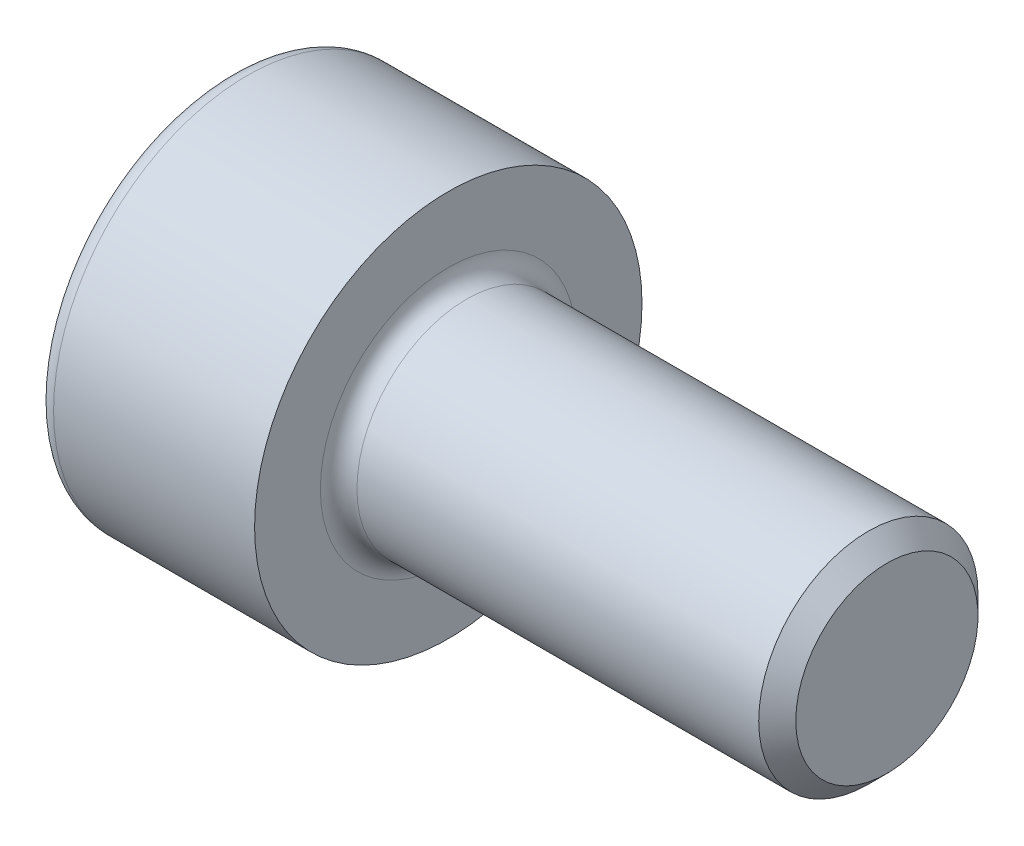
ISO-10303-21;
HEADER;
FILE_DESCRIPTION(('STEP AP214'),'2;1');
FILE_NAME('part.step','',(''),(''),'','','');
FILE_SCHEMA(('AUTOMOTIVE_DESIGN { 1 0 10303 214 1 1 1 1 }'));
ENDSEC;
DATA;
#1=APPLICATION_CONTEXT('core data for automotive mechanical design processes');
#2=APPLICATION_PROTOCOL_DEFINITION('international standard','automotive_design',2000,#1);
#3=PRODUCT_CONTEXT('',#1,'mechanical');
#4=PRODUCT('Part','Part','',(#3));
#5=PRODUCT_RELATED_PRODUCT_CATEGORY('part','',(#4));
#6=PRODUCT_DEFINITION_FORMATION('','',#4);
#7=PRODUCT_DEFINITION_CONTEXT('part definition',#1,'design');
#8=PRODUCT_DEFINITION('design','',#6,#7);
#9=PRODUCT_DEFINITION_SHAPE('','',#8);
#10=(LENGTH_UNIT() NAMED_UNIT(*) SI_UNIT(.MILLI.,.METRE.));
#11=(NAMED_UNIT(*) PLANE_ANGLE_UNIT() SI_UNIT($,.RADIAN.));
#12=(NAMED_UNIT(*) SI_UNIT($,.STERADIAN.) SOLID_ANGLE_UNIT());
#13=UNCERTAINTY_MEASURE_WITH_UNIT(LENGTH_MEASURE(1.E-05),#10,'distance_accuracy_value','');
#14=(GEOMETRIC_REPRESENTATION_CONTEXT(3) GLOBAL_UNCERTAINTY_ASSIGNED_CONTEXT((#13)) GLOBAL_UNIT_ASSIGNED_CONTEXT((#10,
#11,#12)) REPRESENTATION_CONTEXT('',''));
#15=CARTESIAN_POINT('',(0.,0.,0.));
#16=DIRECTION('',(0.,0.,1.));
#17=DIRECTION('',(1.,0.,0.));
#18=AXIS2_PLACEMENT_3D('',#15,#16,#17);
#19=CARTESIAN_POINT('',(6.,0.,0.));
#20=DIRECTION('',(-1.,0.,0.));
#21=DIRECTION('',(0.,0.,1.));
#22=AXIS2_PLACEMENT_3D('',#19,#20,#21);
#23=CONICAL_SURFACE('',#22,1.2464999999935,0.785398163397448);
#24=CARTESIAN_POINT('',(5.7464999999935,0.,0.));
#25=DIRECTION('',(-1.,0.,0.));
#26=DIRECTION('',(0.,0.,1.));
#27=AXIS2_PLACEMENT_3D('',#24,#25,#26);
#28=CIRCLE('',#27,1.5);
#29=CARTESIAN_POINT('',(5.7464999999935,0.,1.5));
#30=VERTEX_POINT('',#29);
#31=EDGE_CURVE('E11',#30,#30,#28,.T.);
#32=ORIENTED_EDGE('',*,*,#31,.F.);
#33=EDGE_LOOP('',(#32));
#34=FACE_BOUND('',#33,.T.);
#35=CARTESIAN_POINT('',(6.,0.,0.));
#36=DIRECTION('',(-1.,0.,0.));
#37=DIRECTION('',(0.,0.,1.));
#38=AXIS2_PLACEMENT_3D('',#35,#36,#37);
#39=CIRCLE('',#38,1.2464999999935);
#40=CARTESIAN_POINT('',(6.,0.,1.2464999999935));
#41=VERTEX_POINT('',#40);
#42=EDGE_CURVE('E134',#41,#41,#39,.T.);
#43=ORIENTED_EDGE('',*,*,#42,.T.);
#44=EDGE_LOOP('',(#43));
#45=FACE_BOUND('',#44,.T.);
#46=ADVANCED_FACE('F33',(#34,#45),#23,.T.);
#47=CARTESIAN_POINT('',(-3.,0.,0.));
#48=DIRECTION('',(-1.,0.,0.));
#49=DIRECTION('',(0.,0.,1.));
#50=AXIS2_PLACEMENT_3D('',#47,#48,#49);
#51=CYLINDRICAL_SURFACE('',#50,1.5);
#52=CARTESIAN_POINT('',(0.25,0.,0.));
#53=DIRECTION('',(-1.,0.,0.));
#54=DIRECTION('',(0.,0.,1.));
#55=AXIS2_PLACEMENT_3D('',#52,#53,#54);
#56=CIRCLE('',#55,1.5);
#57=CARTESIAN_POINT('',(0.25,0.,1.5));
#58=VERTEX_POINT('',#57);
#59=EDGE_CURVE('E40',#58,#58,#56,.T.);
#60=ORIENTED_EDGE('',*,*,#59,.F.);
#61=EDGE_LOOP('',(#60));
#62=FACE_BOUND('',#61,.T.);
#63=ORIENTED_EDGE('',*,*,#31,.T.);
#64=EDGE_LOOP('',(#63));
#65=FACE_BOUND('',#64,.T.);
#66=ADVANCED_FACE('F158',(#62,#65),#51,.T.);
#67=CARTESIAN_POINT('',(0.25,0.,0.));
#68=DIRECTION('',(-1.,0.,0.));
#69=DIRECTION('',(0.,0.,1.));
#70=AXIS2_PLACEMENT_3D('',#67,#68,#69);
#71=TOROIDAL_SURFACE('',#70,1.75,0.25);
#72=CARTESIAN_POINT('',(0.,0.,0.));
#73=DIRECTION('',(-1.,0.,0.));
#74=DIRECTION('',(0.,0.,1.));
#75=AXIS2_PLACEMENT_3D('',#72,#73,#74);
#76=CIRCLE('',#75,1.75);
#77=CARTESIAN_POINT('',(0.,0.,1.75));
#78=VERTEX_POINT('',#77);
#79=EDGE_CURVE('E151',#78,#78,#76,.T.);
#80=ORIENTED_EDGE('',*,*,#79,.F.);
#81=EDGE_LOOP('',(#80));
#82=FACE_BOUND('',#81,.T.);
#83=ORIENTED_EDGE('',*,*,#59,.T.);
#84=EDGE_LOOP('',(#83));
#85=FACE_BOUND('',#84,.T.);
#86=ADVANCED_FACE('F156',(#82,#85),#71,.F.);
#87=CARTESIAN_POINT('',(0.,1.75,0.));
#88=DIRECTION('',(-1.,0.,0.));
#89=DIRECTION('',(0.,0.,1.));
#90=AXIS2_PLACEMENT_3D('',#87,#88,#89);
#91=PLANE('',#90);
#92=CARTESIAN_POINT('',(0.,0.,0.));
#93=DIRECTION('',(-1.,0.,0.));
#94=DIRECTION('',(0.,0.,1.));
#95=AXIS2_PLACEMENT_3D('',#92,#93,#94);
#96=CIRCLE('',#95,2.65);
#97=CARTESIAN_POINT('',(0.,0.,2.65));
#98=VERTEX_POINT('',#97);
#99=EDGE_CURVE('E148',#98,#98,#96,.T.);
#100=ORIENTED_EDGE('',*,*,#99,.F.);
#101=EDGE_LOOP('',(#100));
#102=FACE_BOUND('',#101,.T.);
#103=ORIENTED_EDGE('',*,*,#79,.T.);
#104=EDGE_LOOP('',(#103));
#105=FACE_BOUND('',#104,.T.);
#106=ADVANCED_FACE('F189',(#102,#105),#91,.F.);
#107=CARTESIAN_POINT('',(-3.,0.,0.));
#108=DIRECTION('',(-1.,0.,0.));
#109=DIRECTION('',(0.,0.,1.));
#110=AXIS2_PLACEMENT_3D('',#107,#108,#109);
#111=CYLINDRICAL_SURFACE('',#110,2.65);
#112=CARTESIAN_POINT('',(-2.75,0.,0.));
#113=DIRECTION('',(-1.,0.,0.));
#114=DIRECTION('',(0.,0.,1.));
#115=AXIS2_PLACEMENT_3D('',#112,#113,#114);
#116=CIRCLE('',#115,2.65);
#117=CARTESIAN_POINT('',(-2.75,0.,2.65));
#118=VERTEX_POINT('',#117);
#119=EDGE_CURVE('E145',#118,#118,#116,.T.);
#120=ORIENTED_EDGE('',*,*,#119,.F.);
#121=EDGE_LOOP('',(#120));
#122=FACE_BOUND('',#121,.T.);
#123=ORIENTED_EDGE('',*,*,#99,.T.);
#124=EDGE_LOOP('',(#123));
#125=FACE_BOUND('',#124,.T.);
#126=ADVANCED_FACE('F185',(#122,#125),#111,.T.);
#127=CARTESIAN_POINT('',(-2.75,0.,0.));
#128=DIRECTION('',(-1.,0.,0.));
#129=DIRECTION('',(0.,0.,1.));
#130=AXIS2_PLACEMENT_3D('',#127,#128,#129);
#131=TOROIDAL_SURFACE('',#130,2.4,0.25);
#132=CARTESIAN_POINT('',(-3.,0.,0.));
#133=DIRECTION('',(-1.,0.,0.));
#134=DIRECTION('',(0.,0.,1.));
#135=AXIS2_PLACEMENT_3D('',#132,#133,#134);
#136=CIRCLE('',#135,2.4);
#137=CARTESIAN_POINT('',(-3.,0.,2.4));
#138=VERTEX_POINT('',#137);
#139=EDGE_CURVE('E142',#138,#138,#136,.T.);
#140=ORIENTED_EDGE('',*,*,#139,.F.);
#141=EDGE_LOOP('',(#140));
#142=FACE_BOUND('',#141,.T.);
#143=ORIENTED_EDGE('',*,*,#119,.T.);
#144=EDGE_LOOP('',(#143));
#145=FACE_BOUND('',#144,.T.);
#146=ADVANCED_FACE('F178',(#142,#145),#131,.T.);
#147=CARTESIAN_POINT('',(-3.,2.4,0.));
#148=DIRECTION('',(1.,0.,0.));
#149=DIRECTION('',(0.,0.,-1.));
#150=AXIS2_PLACEMENT_3D('',#147,#148,#149);
#151=PLANE('',#150);
#152=DIRECTION('',(0.,0.5,-0.866025403784438));
#153=VECTOR('',#152,1.);
#154=CARTESIAN_POINT('',(-3.,0.433012701892219,0.75));
#155=LINE('',#154,#153);
#156=CARTESIAN_POINT('',(-3.,0.433012701892219,0.75));
#157=VERTEX_POINT('',#156);
#158=CARTESIAN_POINT('',(-3.,0.866025403784439,0.));
#159=VERTEX_POINT('',#158);
#160=EDGE_CURVE('E121',#157,#159,#155,.T.);
#161=ORIENTED_EDGE('',*,*,#160,.F.);
#162=DIRECTION('',(0.,1.,0.));
#163=VECTOR('',#162,1.);
#164=CARTESIAN_POINT('',(-3.,-0.43301270189222,0.75));
#165=LINE('',#164,#163);
#166=CARTESIAN_POINT('',(-3.,-0.43301270189222,0.75));
#167=VERTEX_POINT('',#166);
#168=EDGE_CURVE('E47',#167,#157,#165,.T.);
#169=ORIENTED_EDGE('',*,*,#168,.F.);
#170=DIRECTION('',(0.,0.5,0.866025403784439));
#171=VECTOR('',#170,1.);
#172=CARTESIAN_POINT('',(-3.,-0.866025403784439,0.));
#173=LINE('',#172,#171);
#174=CARTESIAN_POINT('',(-3.,-0.866025403784439,0.));
#175=VERTEX_POINT('',#174);
#176=EDGE_CURVE('E130',#175,#167,#173,.T.);
#177=ORIENTED_EDGE('',*,*,#176,.F.);
#178=DIRECTION('',(0.,-0.5,0.866025403784439));
#179=VECTOR('',#178,1.);
#180=CARTESIAN_POINT('',(-3.,-0.433012701892219,-0.75));
#181=LINE('',#180,#179);
#182=CARTESIAN_POINT('',(-3.,-0.433012701892219,-0.75));
#183=VERTEX_POINT('',#182);
#184=EDGE_CURVE('E128',#183,#175,#181,.T.);
#185=ORIENTED_EDGE('',*,*,#184,.F.);
#186=DIRECTION('',(0.,-1.,0.));
#187=VECTOR('',#186,1.);
#188=CARTESIAN_POINT('',(-3.,0.43301270189222,-0.75));
#189=LINE('',#188,#187);
#190=CARTESIAN_POINT('',(-3.,0.43301270189222,-0.75));
#191=VERTEX_POINT('',#190);
#192=EDGE_CURVE('E95',#191,#183,#189,.T.);
#193=ORIENTED_EDGE('',*,*,#192,.F.);
#194=DIRECTION('',(0.,-0.5,-0.866025403784439));
#195=VECTOR('',#194,1.);
#196=CARTESIAN_POINT('',(-3.,0.866025403784439,0.));
#197=LINE('',#196,#195);
#198=EDGE_CURVE('E124',#159,#191,#197,.T.);
#199=ORIENTED_EDGE('',*,*,#198,.F.);
#200=EDGE_LOOP('',(#161,#169,#177,#185,#193,#199));
#201=FACE_BOUND('',#200,.T.);
#202=ORIENTED_EDGE('',*,*,#139,.T.);
#203=EDGE_LOOP('',(#202));
#204=FACE_BOUND('',#203,.T.);
#205=ADVANCED_FACE('F170',(#201,#204),#151,.F.);
#206=CARTESIAN_POINT('',(6.,1.2464999999935,0.));
#207=DIRECTION('',(-1.,0.,0.));
#208=DIRECTION('',(0.,0.,1.));
#209=AXIS2_PLACEMENT_3D('',#206,#207,#208);
#210=PLANE('',#209);
#211=ORIENTED_EDGE('',*,*,#42,.F.);
#212=EDGE_LOOP('',(#211));
#213=FACE_BOUND('',#212,.T.);
#214=ADVANCED_FACE('F167',(#213),#210,.F.);
#215=CARTESIAN_POINT('',(-1.9,-0.43301270189222,0.75));
#216=DIRECTION('',(0.,0.,1.));
#217=DIRECTION('',(1.,0.,0.));
#218=AXIS2_PLACEMENT_3D('',#215,#216,#217);
#219=PLANE('',#218);
#220=ORIENTED_EDGE('',*,*,#168,.T.);
#221=DIRECTION('',(-1.,0.,0.));
#222=VECTOR('',#221,1.);
#223=CARTESIAN_POINT('',(-1.9,0.433012701892219,0.75));
#224=LINE('',#223,#222);
#225=CARTESIAN_POINT('',(-1.9,0.433012701892219,0.75));
#226=VERTEX_POINT('',#225);
#227=EDGE_CURVE('E77',#226,#157,#224,.T.);
#228=ORIENTED_EDGE('',*,*,#227,.F.);
#229=DIRECTION('',(0.,1.,0.));
#230=VECTOR('',#229,1.);
#231=CARTESIAN_POINT('',(-1.9,-0.43301270189222,0.75));
#232=LINE('',#231,#230);
#233=CARTESIAN_POINT('',(-1.9,-0.43301270189222,0.75));
#234=VERTEX_POINT('',#233);
#235=EDGE_CURVE('E132',#234,#226,#232,.T.);
#236=ORIENTED_EDGE('',*,*,#235,.F.);
#237=DIRECTION('',(-1.,0.,0.));
#238=VECTOR('',#237,1.);
#239=CARTESIAN_POINT('',(-1.9,-0.43301270189222,0.75));
#240=LINE('',#239,#238);
#241=EDGE_CURVE('E55',#234,#167,#240,.T.);
#242=ORIENTED_EDGE('',*,*,#241,.T.);
#243=EDGE_LOOP('',(#220,#228,#236,#242));
#244=FACE_BOUND('',#243,.T.);
#245=ADVANCED_FACE('F169',(#244),#219,.F.);
#246=CARTESIAN_POINT('',(-1.9,-0.866025403784439,0.));
#247=DIRECTION('',(0.,-0.866025403784439,0.5));
#248=DIRECTION('',(0.,-0.5,-0.866025403784439));
#249=AXIS2_PLACEMENT_3D('',#246,#247,#248);
#250=PLANE('',#249);
#251=ORIENTED_EDGE('',*,*,#176,.T.);
#252=ORIENTED_EDGE('',*,*,#241,.F.);
#253=DIRECTION('',(0.,0.5,0.866025403784439));
#254=VECTOR('',#253,1.);
#255=CARTESIAN_POINT('',(-1.9,-0.866025403784439,0.));
#256=LINE('',#255,#254);
#257=CARTESIAN_POINT('',(-1.9,-0.866025403784439,0.));
#258=VERTEX_POINT('',#257);
#259=EDGE_CURVE('E107',#258,#234,#256,.T.);
#260=ORIENTED_EDGE('',*,*,#259,.F.);
#261=DIRECTION('',(-1.,0.,0.));
#262=VECTOR('',#261,1.);
#263=CARTESIAN_POINT('',(-1.9,-0.866025403784439,0.));
#264=LINE('',#263,#262);
#265=EDGE_CURVE('E99',#258,#175,#264,.T.);
#266=ORIENTED_EDGE('',*,*,#265,.T.);
#267=EDGE_LOOP('',(#251,#252,#260,#266));
#268=FACE_BOUND('',#267,.T.);
#269=ADVANCED_FACE('F176',(#268),#250,.F.);
#270=CARTESIAN_POINT('',(-1.9,-0.433012701892219,-0.75));
#271=DIRECTION('',(0.,-0.866025403784439,-0.5));
#272=DIRECTION('',(0.,0.5,-0.866025403784439));
#273=AXIS2_PLACEMENT_3D('',#270,#271,#272);
#274=PLANE('',#273);
#275=ORIENTED_EDGE('',*,*,#184,.T.);
#276=ORIENTED_EDGE('',*,*,#265,.F.);
#277=DIRECTION('',(0.,-0.5,0.866025403784439));
#278=VECTOR('',#277,1.);
#279=CARTESIAN_POINT('',(-1.9,-0.433012701892219,-0.75));
#280=LINE('',#279,#278);
#281=CARTESIAN_POINT('',(-1.9,-0.433012701892219,-0.75));
#282=VERTEX_POINT('',#281);
#283=EDGE_CURVE('E103',#282,#258,#280,.T.);
#284=ORIENTED_EDGE('',*,*,#283,.F.);
#285=DIRECTION('',(-1.,0.,0.));
#286=VECTOR('',#285,1.);
#287=CARTESIAN_POINT('',(-1.9,-0.433012701892219,-0.75));
#288=LINE('',#287,#286);
#289=EDGE_CURVE('E88',#282,#183,#288,.T.);
#290=ORIENTED_EDGE('',*,*,#289,.T.);
#291=EDGE_LOOP('',(#275,#276,#284,#290));
#292=FACE_BOUND('',#291,.T.);
#293=ADVANCED_FACE('F104',(#292),#274,.F.);
#294=CARTESIAN_POINT('',(-1.9,0.43301270189222,-0.75));
#295=DIRECTION('',(0.,0.,-1.));
#296=DIRECTION('',(0.,1.,0.));
#297=AXIS2_PLACEMENT_3D('',#294,#295,#296);
#298=PLANE('',#297);
#299=ORIENTED_EDGE('',*,*,#192,.T.);
#300=ORIENTED_EDGE('',*,*,#289,.F.);
#301=DIRECTION('',(0.,-1.,0.));
#302=VECTOR('',#301,1.);
#303=CARTESIAN_POINT('',(-1.9,0.43301270189222,-0.75));
#304=LINE('',#303,#302);
#305=CARTESIAN_POINT('',(-1.9,0.43301270189222,-0.75));
#306=VERTEX_POINT('',#305);
#307=EDGE_CURVE('E92',#306,#282,#304,.T.);
#308=ORIENTED_EDGE('',*,*,#307,.F.);
#309=DIRECTION('',(-1.,0.,0.));
#310=VECTOR('',#309,1.);
#311=CARTESIAN_POINT('',(-1.9,0.43301270189222,-0.75));
#312=LINE('',#311,#310);
#313=EDGE_CURVE('E100',#306,#191,#312,.T.);
#314=ORIENTED_EDGE('',*,*,#313,.T.);
#315=EDGE_LOOP('',(#299,#300,#308,#314));
#316=FACE_BOUND('',#315,.T.);
#317=ADVANCED_FACE('F90',(#316),#298,.F.);
#318=CARTESIAN_POINT('',(-1.9,0.866025403784439,0.));
#319=DIRECTION('',(0.,0.866025403784439,-0.5));
#320=DIRECTION('',(0.,0.5,0.866025403784439));
#321=AXIS2_PLACEMENT_3D('',#318,#319,#320);
#322=PLANE('',#321);
#323=ORIENTED_EDGE('',*,*,#198,.T.);
#324=ORIENTED_EDGE('',*,*,#313,.F.);
#325=DIRECTION('',(0.,-0.5,-0.866025403784439));
#326=VECTOR('',#325,1.);
#327=CARTESIAN_POINT('',(-1.9,0.866025403784439,0.));
#328=LINE('',#327,#326);
#329=CARTESIAN_POINT('',(-1.9,0.866025403784439,0.));
#330=VERTEX_POINT('',#329);
#331=EDGE_CURVE('E113',#330,#306,#328,.T.);
#332=ORIENTED_EDGE('',*,*,#331,.F.);
#333=DIRECTION('',(-1.,0.,0.));
#334=VECTOR('',#333,1.);
#335=CARTESIAN_POINT('',(-1.9,0.866025403784439,0.));
#336=LINE('',#335,#334);
#337=EDGE_CURVE('E137',#330,#159,#336,.T.);
#338=ORIENTED_EDGE('',*,*,#337,.T.);
#339=EDGE_LOOP('',(#323,#324,#332,#338));
#340=FACE_BOUND('',#339,.T.);
#341=ADVANCED_FACE('F251',(#340),#322,.F.);
#342=CARTESIAN_POINT('',(-1.9,0.433012701892219,0.75));
#343=DIRECTION('',(0.,0.866025403784439,0.5));
#344=DIRECTION('',(0.,-0.5,0.866025403784438));
#345=AXIS2_PLACEMENT_3D('',#342,#343,#344);
#346=PLANE('',#345);
#347=ORIENTED_EDGE('',*,*,#160,.T.);
#348=ORIENTED_EDGE('',*,*,#337,.F.);
#349=DIRECTION('',(0.,0.5,-0.866025403784438));
#350=VECTOR('',#349,1.);
#351=CARTESIAN_POINT('',(-1.9,0.433012701892219,0.75));
#352=LINE('',#351,#350);
#353=EDGE_CURVE('E115',#226,#330,#352,.T.);
#354=ORIENTED_EDGE('',*,*,#353,.F.);
#355=ORIENTED_EDGE('',*,*,#227,.T.);
#356=EDGE_LOOP('',(#347,#348,#354,#355));
#357=FACE_BOUND('',#356,.T.);
#358=ADVANCED_FACE('F260',(#357),#346,.F.);
#359=CARTESIAN_POINT('',(-1.9,0.,0.));
#360=DIRECTION('',(-1.,0.,0.));
#361=DIRECTION('',(0.,0.,1.));
#362=AXIS2_PLACEMENT_3D('',#359,#360,#361);
#363=PLANE('',#362);
#364=ORIENTED_EDGE('',*,*,#235,.T.);
#365=ORIENTED_EDGE('',*,*,#353,.T.);
#366=ORIENTED_EDGE('',*,*,#331,.T.);
#367=ORIENTED_EDGE('',*,*,#307,.T.);
#368=ORIENTED_EDGE('',*,*,#283,.T.);
#369=ORIENTED_EDGE('',*,*,#259,.T.);
#370=EDGE_LOOP('',(#364,#365,#366,#367,#368,#369));
#371=FACE_BOUND('',#370,.T.);
#372=ADVANCED_FACE('F110',(#371),#363,.T.);
#373=CLOSED_SHELL('',(#46,#66,#86,#106,#126,#146,#205,#214,#245,#269,#293,#317,#341,#358,#372));
#374=MANIFOLD_SOLID_BREP('B2',#373);
#375=ADVANCED_BREP_SHAPE_REPRESENTATION('',(#18,#374),#14);
#376=SHAPE_DEFINITION_REPRESENTATION(#9,#375);
ENDSEC;
END-ISO-10303-21;
